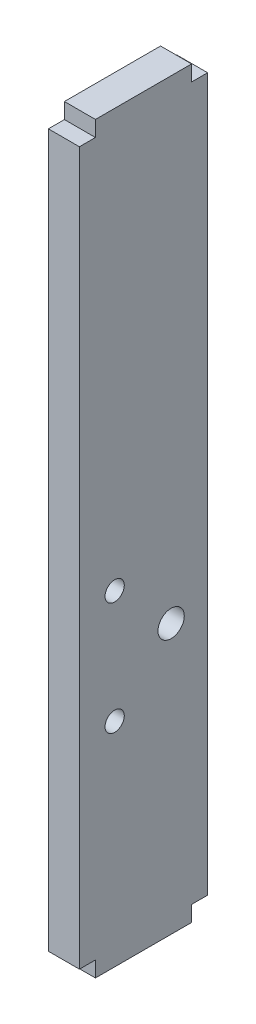
ISO-10303-21;
HEADER;
FILE_DESCRIPTION(('STEP AP214'),'2;1');
FILE_NAME('part.step','',(''),(''),'','','');
FILE_SCHEMA(('AUTOMOTIVE_DESIGN { 1 0 10303 214 1 1 1 1 }'));
ENDSEC;
DATA;
#1=APPLICATION_CONTEXT('core data for automotive mechanical design processes');
#2=APPLICATION_PROTOCOL_DEFINITION('international standard','automotive_design',2000,#1);
#3=PRODUCT_CONTEXT('',#1,'mechanical');
#4=PRODUCT('Part','Part','',(#3));
#5=PRODUCT_RELATED_PRODUCT_CATEGORY('part','',(#4));
#6=PRODUCT_DEFINITION_FORMATION('','',#4);
#7=PRODUCT_DEFINITION_CONTEXT('part definition',#1,'design');
#8=PRODUCT_DEFINITION('design','',#6,#7);
#9=PRODUCT_DEFINITION_SHAPE('','',#8);
#10=(LENGTH_UNIT() NAMED_UNIT(*) SI_UNIT(.MILLI.,.METRE.));
#11=(NAMED_UNIT(*) PLANE_ANGLE_UNIT() SI_UNIT($,.RADIAN.));
#12=(NAMED_UNIT(*) SI_UNIT($,.STERADIAN.) SOLID_ANGLE_UNIT());
#13=UNCERTAINTY_MEASURE_WITH_UNIT(LENGTH_MEASURE(1.E-05),#10,'distance_accuracy_value','');
#14=(GEOMETRIC_REPRESENTATION_CONTEXT(3) GLOBAL_UNCERTAINTY_ASSIGNED_CONTEXT((#13)) GLOBAL_UNIT_ASSIGNED_CONTEXT((#10,
#11,#12)) REPRESENTATION_CONTEXT('',''));
#15=CARTESIAN_POINT('',(0.,0.,0.));
#16=DIRECTION('',(0.,0.,1.));
#17=DIRECTION('',(1.,0.,0.));
#18=AXIS2_PLACEMENT_3D('',#15,#16,#17);
#19=CARTESIAN_POINT('',(4.84,0.,0.));
#20=DIRECTION('',(1.,0.,0.));
#21=DIRECTION('',(0.,0.,-1.));
#22=AXIS2_PLACEMENT_3D('',#19,#20,#21);
#23=PLANE('',#22);
#24=CARTESIAN_POINT('',(4.84,8.81,4.5));
#25=DIRECTION('',(1.,0.,0.));
#26=DIRECTION('',(0.,0.,-1.));
#27=AXIS2_PLACEMENT_3D('',#24,#25,#26);
#28=CIRCLE('',#27,1.5);
#29=CARTESIAN_POINT('',(4.84,8.81,3.));
#30=VERTEX_POINT('',#29);
#31=EDGE_CURVE('E254',#30,#30,#28,.T.);
#32=ORIENTED_EDGE('',*,*,#31,.F.);
#33=EDGE_LOOP('',(#32));
#34=FACE_BOUND('',#33,.T.);
#35=DIRECTION('',(0.,-1.,0.));
#36=VECTOR('',#35,1.);
#37=CARTESIAN_POINT('',(4.84,0.,10.));
#38=LINE('',#37,#36);
#39=CARTESIAN_POINT('',(4.84,71.56,10.));
#40=VERTEX_POINT('',#39);
#41=CARTESIAN_POINT('',(4.84,-39.56,9.99999999999999));
#42=VERTEX_POINT('',#41);
#43=EDGE_CURVE('E51',#40,#42,#38,.T.);
#44=ORIENTED_EDGE('',*,*,#43,.T.);
#45=DIRECTION('',(0.,0.,-1.));
#46=VECTOR('',#45,1.);
#47=CARTESIAN_POINT('',(4.84,-39.56,9.99999999999999));
#48=LINE('',#47,#46);
#49=CARTESIAN_POINT('',(4.84,-39.56,7.5));
#50=VERTEX_POINT('',#49);
#51=EDGE_CURVE('E107',#42,#50,#48,.T.);
#52=ORIENTED_EDGE('',*,*,#51,.T.);
#53=DIRECTION('',(0.,-1.,0.));
#54=VECTOR('',#53,1.);
#55=CARTESIAN_POINT('',(4.84,-42.,7.5));
#56=LINE('',#55,#54);
#57=CARTESIAN_POINT('',(4.84,-42.,7.5));
#58=VERTEX_POINT('',#57);
#59=EDGE_CURVE('E207',#50,#58,#56,.T.);
#60=ORIENTED_EDGE('',*,*,#59,.T.);
#61=DIRECTION('',(0.,0.,-1.));
#62=VECTOR('',#61,1.);
#63=CARTESIAN_POINT('',(4.84,-42.,7.5));
#64=LINE('',#63,#62);
#65=CARTESIAN_POINT('',(4.84,-42.,-7.5));
#66=VERTEX_POINT('',#65);
#67=EDGE_CURVE('E227',#58,#66,#64,.T.);
#68=ORIENTED_EDGE('',*,*,#67,.T.);
#69=DIRECTION('',(0.,1.,0.));
#70=VECTOR('',#69,1.);
#71=CARTESIAN_POINT('',(4.84,-42.,-7.5));
#72=LINE('',#71,#70);
#73=CARTESIAN_POINT('',(4.84,-39.56,-7.5));
#74=VERTEX_POINT('',#73);
#75=EDGE_CURVE('E224',#66,#74,#72,.T.);
#76=ORIENTED_EDGE('',*,*,#75,.T.);
#77=DIRECTION('',(0.,0.,-1.));
#78=VECTOR('',#77,1.);
#79=CARTESIAN_POINT('',(4.84,-39.56,-7.5));
#80=LINE('',#79,#78);
#81=CARTESIAN_POINT('',(4.84,-39.56,-10.));
#82=VERTEX_POINT('',#81);
#83=EDGE_CURVE('E226',#74,#82,#80,.T.);
#84=ORIENTED_EDGE('',*,*,#83,.T.);
#85=DIRECTION('',(0.,1.,0.));
#86=VECTOR('',#85,1.);
#87=CARTESIAN_POINT('',(4.84,71.56,-10.));
#88=LINE('',#87,#86);
#89=CARTESIAN_POINT('',(4.84,71.56,-10.));
#90=VERTEX_POINT('',#89);
#91=EDGE_CURVE('E229',#82,#90,#88,.T.);
#92=ORIENTED_EDGE('',*,*,#91,.T.);
#93=DIRECTION('',(0.,0.,1.));
#94=VECTOR('',#93,1.);
#95=CARTESIAN_POINT('',(4.84,71.56,-7.5));
#96=LINE('',#95,#94);
#97=CARTESIAN_POINT('',(4.84,71.56,-7.5));
#98=VERTEX_POINT('',#97);
#99=EDGE_CURVE('E235',#90,#98,#96,.T.);
#100=ORIENTED_EDGE('',*,*,#99,.T.);
#101=DIRECTION('',(0.,1.,0.));
#102=VECTOR('',#101,1.);
#103=CARTESIAN_POINT('',(4.84,74.,-7.5));
#104=LINE('',#103,#102);
#105=CARTESIAN_POINT('',(4.84,74.,-7.5));
#106=VERTEX_POINT('',#105);
#107=EDGE_CURVE('E139',#98,#106,#104,.T.);
#108=ORIENTED_EDGE('',*,*,#107,.T.);
#109=DIRECTION('',(0.,0.,1.));
#110=VECTOR('',#109,1.);
#111=CARTESIAN_POINT('',(4.84,74.,7.5));
#112=LINE('',#111,#110);
#113=CARTESIAN_POINT('',(4.84,74.,7.5));
#114=VERTEX_POINT('',#113);
#115=EDGE_CURVE('E133',#106,#114,#112,.T.);
#116=ORIENTED_EDGE('',*,*,#115,.T.);
#117=DIRECTION('',(0.,-1.,0.));
#118=VECTOR('',#117,1.);
#119=CARTESIAN_POINT('',(4.84,71.56,7.5));
#120=LINE('',#119,#118);
#121=CARTESIAN_POINT('',(4.84,71.56,7.5));
#122=VERTEX_POINT('',#121);
#123=EDGE_CURVE('E137',#114,#122,#120,.T.);
#124=ORIENTED_EDGE('',*,*,#123,.T.);
#125=DIRECTION('',(0.,0.,1.));
#126=VECTOR('',#125,1.);
#127=CARTESIAN_POINT('',(4.84,71.56,10.));
#128=LINE('',#127,#126);
#129=EDGE_CURVE('E153',#122,#40,#128,.T.);
#130=ORIENTED_EDGE('',*,*,#129,.T.);
#131=EDGE_LOOP('',(#44,#52,#60,#68,#76,#84,#92,#100,#108,#116,#124,#130));
#132=FACE_BOUND('',#131,.T.);
#133=CARTESIAN_POINT('',(4.84,0.,-4.31));
#134=DIRECTION('',(1.,0.,0.));
#135=DIRECTION('',(0.,0.,-1.));
#136=AXIS2_PLACEMENT_3D('',#133,#134,#135);
#137=CIRCLE('',#136,2.05);
#138=CARTESIAN_POINT('',(4.84,0.,-6.36));
#139=VERTEX_POINT('',#138);
#140=EDGE_CURVE('E162',#139,#139,#137,.T.);
#141=ORIENTED_EDGE('',*,*,#140,.F.);
#142=EDGE_LOOP('',(#141));
#143=FACE_BOUND('',#142,.T.);
#144=CARTESIAN_POINT('',(4.84,-8.81,4.5));
#145=DIRECTION('',(1.,0.,0.));
#146=DIRECTION('',(0.,0.,1.));
#147=AXIS2_PLACEMENT_3D('',#144,#145,#146);
#148=CIRCLE('',#147,1.5);
#149=CARTESIAN_POINT('',(4.84,-8.81,6.));
#150=VERTEX_POINT('',#149);
#151=EDGE_CURVE('E260',#150,#150,#148,.T.);
#152=ORIENTED_EDGE('',*,*,#151,.F.);
#153=EDGE_LOOP('',(#152));
#154=FACE_BOUND('',#153,.T.);
#155=ADVANCED_FACE('F34',(#34,#132,#143,#154),#23,.T.);
#156=CARTESIAN_POINT('',(0.,0.,0.));
#157=DIRECTION('',(1.,0.,0.));
#158=DIRECTION('',(0.,0.,-1.));
#159=AXIS2_PLACEMENT_3D('',#156,#157,#158);
#160=PLANE('',#159);
#161=CARTESIAN_POINT('',(0.,8.81,4.5));
#162=DIRECTION('',(1.,0.,0.));
#163=DIRECTION('',(0.,0.,-1.));
#164=AXIS2_PLACEMENT_3D('',#161,#162,#163);
#165=CIRCLE('',#164,1.5);
#166=CARTESIAN_POINT('',(0.,8.81,3.));
#167=VERTEX_POINT('',#166);
#168=EDGE_CURVE('E257',#167,#167,#165,.T.);
#169=ORIENTED_EDGE('',*,*,#168,.T.);
#170=EDGE_LOOP('',(#169));
#171=FACE_BOUND('',#170,.T.);
#172=DIRECTION('',(0.,0.,-1.));
#173=VECTOR('',#172,1.);
#174=CARTESIAN_POINT('',(0.,-39.56,9.99999999999999));
#175=LINE('',#174,#173);
#176=CARTESIAN_POINT('',(0.,-39.56,9.99999999999999));
#177=VERTEX_POINT('',#176);
#178=CARTESIAN_POINT('',(0.,-39.56,7.5));
#179=VERTEX_POINT('',#178);
#180=EDGE_CURVE('E159',#177,#179,#175,.T.);
#181=ORIENTED_EDGE('',*,*,#180,.F.);
#182=DIRECTION('',(0.,-1.,0.));
#183=VECTOR('',#182,1.);
#184=CARTESIAN_POINT('',(0.,0.,10.));
#185=LINE('',#184,#183);
#186=CARTESIAN_POINT('',(0.,71.56,10.));
#187=VERTEX_POINT('',#186);
#188=EDGE_CURVE('E179',#187,#177,#185,.T.);
#189=ORIENTED_EDGE('',*,*,#188,.F.);
#190=DIRECTION('',(0.,0.,1.));
#191=VECTOR('',#190,1.);
#192=CARTESIAN_POINT('',(0.,71.56,10.));
#193=LINE('',#192,#191);
#194=CARTESIAN_POINT('',(0.,71.56,7.5));
#195=VERTEX_POINT('',#194);
#196=EDGE_CURVE('E100',#195,#187,#193,.T.);
#197=ORIENTED_EDGE('',*,*,#196,.F.);
#198=DIRECTION('',(0.,-1.,0.));
#199=VECTOR('',#198,1.);
#200=CARTESIAN_POINT('',(0.,71.56,7.5));
#201=LINE('',#200,#199);
#202=CARTESIAN_POINT('',(0.,74.,7.5));
#203=VERTEX_POINT('',#202);
#204=EDGE_CURVE('E93',#203,#195,#201,.T.);
#205=ORIENTED_EDGE('',*,*,#204,.F.);
#206=DIRECTION('',(0.,0.,1.));
#207=VECTOR('',#206,1.);
#208=CARTESIAN_POINT('',(0.,74.,7.5));
#209=LINE('',#208,#207);
#210=CARTESIAN_POINT('',(0.,74.,-7.5));
#211=VERTEX_POINT('',#210);
#212=EDGE_CURVE('E147',#211,#203,#209,.T.);
#213=ORIENTED_EDGE('',*,*,#212,.F.);
#214=DIRECTION('',(0.,1.,0.));
#215=VECTOR('',#214,1.);
#216=CARTESIAN_POINT('',(0.,74.,-7.5));
#217=LINE('',#216,#215);
#218=CARTESIAN_POINT('',(0.,71.56,-7.5));
#219=VERTEX_POINT('',#218);
#220=EDGE_CURVE('E174',#219,#211,#217,.T.);
#221=ORIENTED_EDGE('',*,*,#220,.F.);
#222=DIRECTION('',(0.,0.,1.));
#223=VECTOR('',#222,1.);
#224=CARTESIAN_POINT('',(0.,71.56,-7.5));
#225=LINE('',#224,#223);
#226=CARTESIAN_POINT('',(0.,71.56,-10.));
#227=VERTEX_POINT('',#226);
#228=EDGE_CURVE('E172',#227,#219,#225,.T.);
#229=ORIENTED_EDGE('',*,*,#228,.F.);
#230=DIRECTION('',(0.,1.,0.));
#231=VECTOR('',#230,1.);
#232=CARTESIAN_POINT('',(0.,71.56,-10.));
#233=LINE('',#232,#231);
#234=CARTESIAN_POINT('',(0.,-39.56,-10.));
#235=VERTEX_POINT('',#234);
#236=EDGE_CURVE('E170',#235,#227,#233,.T.);
#237=ORIENTED_EDGE('',*,*,#236,.F.);
#238=DIRECTION('',(0.,0.,-1.));
#239=VECTOR('',#238,1.);
#240=CARTESIAN_POINT('',(0.,-39.56,-7.5));
#241=LINE('',#240,#239);
#242=CARTESIAN_POINT('',(0.,-39.56,-7.5));
#243=VERTEX_POINT('',#242);
#244=EDGE_CURVE('E168',#243,#235,#241,.T.);
#245=ORIENTED_EDGE('',*,*,#244,.F.);
#246=DIRECTION('',(0.,1.,0.));
#247=VECTOR('',#246,1.);
#248=CARTESIAN_POINT('',(0.,-42.,-7.5));
#249=LINE('',#248,#247);
#250=CARTESIAN_POINT('',(0.,-42.,-7.5));
#251=VERTEX_POINT('',#250);
#252=EDGE_CURVE('E166',#251,#243,#249,.T.);
#253=ORIENTED_EDGE('',*,*,#252,.F.);
#254=DIRECTION('',(0.,0.,-1.));
#255=VECTOR('',#254,1.);
#256=CARTESIAN_POINT('',(0.,-42.,7.5));
#257=LINE('',#256,#255);
#258=CARTESIAN_POINT('',(0.,-42.,7.5));
#259=VERTEX_POINT('',#258);
#260=EDGE_CURVE('E164',#259,#251,#257,.T.);
#261=ORIENTED_EDGE('',*,*,#260,.F.);
#262=DIRECTION('',(0.,-1.,0.));
#263=VECTOR('',#262,1.);
#264=CARTESIAN_POINT('',(0.,-42.,7.5));
#265=LINE('',#264,#263);
#266=EDGE_CURVE('E161',#179,#259,#265,.T.);
#267=ORIENTED_EDGE('',*,*,#266,.F.);
#268=EDGE_LOOP('',(#181,#189,#197,#205,#213,#221,#229,#237,#245,#253,#261,#267));
#269=FACE_BOUND('',#268,.T.);
#270=CARTESIAN_POINT('',(0.,0.,-4.31));
#271=DIRECTION('',(1.,0.,0.));
#272=DIRECTION('',(0.,0.,-1.));
#273=AXIS2_PLACEMENT_3D('',#270,#271,#272);
#274=CIRCLE('',#273,2.05);
#275=CARTESIAN_POINT('',(0.,0.,-6.36));
#276=VERTEX_POINT('',#275);
#277=EDGE_CURVE('E251',#276,#276,#274,.T.);
#278=ORIENTED_EDGE('',*,*,#277,.T.);
#279=EDGE_LOOP('',(#278));
#280=FACE_BOUND('',#279,.T.);
#281=CARTESIAN_POINT('',(0.,-8.81,4.5));
#282=DIRECTION('',(1.,0.,0.));
#283=DIRECTION('',(0.,0.,1.));
#284=AXIS2_PLACEMENT_3D('',#281,#282,#283);
#285=CIRCLE('',#284,1.5);
#286=CARTESIAN_POINT('',(0.,-8.81,6.));
#287=VERTEX_POINT('',#286);
#288=EDGE_CURVE('E263',#287,#287,#285,.T.);
#289=ORIENTED_EDGE('',*,*,#288,.T.);
#290=EDGE_LOOP('',(#289));
#291=FACE_BOUND('',#290,.T.);
#292=ADVANCED_FACE('F211',(#171,#269,#280,#291),#160,.F.);
#293=CARTESIAN_POINT('',(4.84,-39.56,9.99999999999999));
#294=DIRECTION('',(0.,1.,0.));
#295=DIRECTION('',(0.,0.,1.));
#296=AXIS2_PLACEMENT_3D('',#293,#294,#295);
#297=PLANE('',#296);
#298=ORIENTED_EDGE('',*,*,#180,.T.);
#299=DIRECTION('',(-1.,0.,0.));
#300=VECTOR('',#299,1.);
#301=CARTESIAN_POINT('',(4.84,-39.56,7.5));
#302=LINE('',#301,#300);
#303=EDGE_CURVE('E43',#50,#179,#302,.T.);
#304=ORIENTED_EDGE('',*,*,#303,.F.);
#305=ORIENTED_EDGE('',*,*,#51,.F.);
#306=DIRECTION('',(-1.,0.,0.));
#307=VECTOR('',#306,1.);
#308=CARTESIAN_POINT('',(4.84,-39.56,9.99999999999999));
#309=LINE('',#308,#307);
#310=EDGE_CURVE('E11',#42,#177,#309,.T.);
#311=ORIENTED_EDGE('',*,*,#310,.T.);
#312=EDGE_LOOP('',(#298,#304,#305,#311));
#313=FACE_BOUND('',#312,.T.);
#314=ADVANCED_FACE('F36',(#313),#297,.F.);
#315=CARTESIAN_POINT('',(4.84,-42.,7.5));
#316=DIRECTION('',(0.,0.,-1.));
#317=DIRECTION('',(-1.,0.,0.));
#318=AXIS2_PLACEMENT_3D('',#315,#316,#317);
#319=PLANE('',#318);
#320=ORIENTED_EDGE('',*,*,#266,.T.);
#321=DIRECTION('',(-1.,0.,0.));
#322=VECTOR('',#321,1.);
#323=CARTESIAN_POINT('',(4.84,-42.,7.5));
#324=LINE('',#323,#322);
#325=EDGE_CURVE('E199',#58,#259,#324,.T.);
#326=ORIENTED_EDGE('',*,*,#325,.F.);
#327=ORIENTED_EDGE('',*,*,#59,.F.);
#328=ORIENTED_EDGE('',*,*,#303,.T.);
#329=EDGE_LOOP('',(#320,#326,#327,#328));
#330=FACE_BOUND('',#329,.T.);
#331=ADVANCED_FACE('F205',(#330),#319,.F.);
#332=CARTESIAN_POINT('',(4.84,-42.,7.5));
#333=DIRECTION('',(0.,1.,0.));
#334=DIRECTION('',(0.,0.,1.));
#335=AXIS2_PLACEMENT_3D('',#332,#333,#334);
#336=PLANE('',#335);
#337=ORIENTED_EDGE('',*,*,#260,.T.);
#338=DIRECTION('',(-1.,0.,0.));
#339=VECTOR('',#338,1.);
#340=CARTESIAN_POINT('',(4.84,-42.,-7.5));
#341=LINE('',#340,#339);
#342=EDGE_CURVE('E196',#66,#251,#341,.T.);
#343=ORIENTED_EDGE('',*,*,#342,.F.);
#344=ORIENTED_EDGE('',*,*,#67,.F.);
#345=ORIENTED_EDGE('',*,*,#325,.T.);
#346=EDGE_LOOP('',(#337,#343,#344,#345));
#347=FACE_BOUND('',#346,.T.);
#348=ADVANCED_FACE('F218',(#347),#336,.F.);
#349=CARTESIAN_POINT('',(4.84,-42.,-7.5));
#350=DIRECTION('',(0.,0.,1.));
#351=DIRECTION('',(1.,0.,0.));
#352=AXIS2_PLACEMENT_3D('',#349,#350,#351);
#353=PLANE('',#352);
#354=ORIENTED_EDGE('',*,*,#252,.T.);
#355=DIRECTION('',(-1.,0.,0.));
#356=VECTOR('',#355,1.);
#357=CARTESIAN_POINT('',(4.84,-39.56,-7.5));
#358=LINE('',#357,#356);
#359=EDGE_CURVE('E193',#74,#243,#358,.T.);
#360=ORIENTED_EDGE('',*,*,#359,.F.);
#361=ORIENTED_EDGE('',*,*,#75,.F.);
#362=ORIENTED_EDGE('',*,*,#342,.T.);
#363=EDGE_LOOP('',(#354,#360,#361,#362));
#364=FACE_BOUND('',#363,.T.);
#365=ADVANCED_FACE('F222',(#364),#353,.F.);
#366=CARTESIAN_POINT('',(4.84,-39.56,-7.5));
#367=DIRECTION('',(0.,1.,0.));
#368=DIRECTION('',(0.,0.,1.));
#369=AXIS2_PLACEMENT_3D('',#366,#367,#368);
#370=PLANE('',#369);
#371=ORIENTED_EDGE('',*,*,#244,.T.);
#372=DIRECTION('',(-1.,0.,0.));
#373=VECTOR('',#372,1.);
#374=CARTESIAN_POINT('',(4.84,-39.56,-10.));
#375=LINE('',#374,#373);
#376=EDGE_CURVE('E190',#82,#235,#375,.T.);
#377=ORIENTED_EDGE('',*,*,#376,.F.);
#378=ORIENTED_EDGE('',*,*,#83,.F.);
#379=ORIENTED_EDGE('',*,*,#359,.T.);
#380=EDGE_LOOP('',(#371,#377,#378,#379));
#381=FACE_BOUND('',#380,.T.);
#382=ADVANCED_FACE('F300',(#381),#370,.F.);
#383=CARTESIAN_POINT('',(4.84,71.56,-10.));
#384=DIRECTION('',(0.,0.,1.));
#385=DIRECTION('',(0.,-1.,0.));
#386=AXIS2_PLACEMENT_3D('',#383,#384,#385);
#387=PLANE('',#386);
#388=ORIENTED_EDGE('',*,*,#236,.T.);
#389=DIRECTION('',(-1.,0.,0.));
#390=VECTOR('',#389,1.);
#391=CARTESIAN_POINT('',(4.84,71.56,-10.));
#392=LINE('',#391,#390);
#393=EDGE_CURVE('E187',#90,#227,#392,.T.);
#394=ORIENTED_EDGE('',*,*,#393,.F.);
#395=ORIENTED_EDGE('',*,*,#91,.F.);
#396=ORIENTED_EDGE('',*,*,#376,.T.);
#397=EDGE_LOOP('',(#388,#394,#395,#396));
#398=FACE_BOUND('',#397,.T.);
#399=ADVANCED_FACE('F297',(#398),#387,.F.);
#400=CARTESIAN_POINT('',(4.84,71.56,-7.5));
#401=DIRECTION('',(0.,-1.,0.));
#402=DIRECTION('',(0.,0.,-1.));
#403=AXIS2_PLACEMENT_3D('',#400,#401,#402);
#404=PLANE('',#403);
#405=ORIENTED_EDGE('',*,*,#228,.T.);
#406=DIRECTION('',(-1.,0.,0.));
#407=VECTOR('',#406,1.);
#408=CARTESIAN_POINT('',(4.84,71.56,-7.5));
#409=LINE('',#408,#407);
#410=EDGE_CURVE('E184',#98,#219,#409,.T.);
#411=ORIENTED_EDGE('',*,*,#410,.F.);
#412=ORIENTED_EDGE('',*,*,#99,.F.);
#413=ORIENTED_EDGE('',*,*,#393,.T.);
#414=EDGE_LOOP('',(#405,#411,#412,#413));
#415=FACE_BOUND('',#414,.T.);
#416=ADVANCED_FACE('F241',(#415),#404,.F.);
#417=CARTESIAN_POINT('',(4.84,74.,-7.5));
#418=DIRECTION('',(0.,0.,1.));
#419=DIRECTION('',(1.,0.,0.));
#420=AXIS2_PLACEMENT_3D('',#417,#418,#419);
#421=PLANE('',#420);
#422=ORIENTED_EDGE('',*,*,#220,.T.);
#423=DIRECTION('',(-1.,0.,0.));
#424=VECTOR('',#423,1.);
#425=CARTESIAN_POINT('',(4.84,74.,-7.5));
#426=LINE('',#425,#424);
#427=EDGE_CURVE('E148',#106,#211,#426,.T.);
#428=ORIENTED_EDGE('',*,*,#427,.F.);
#429=ORIENTED_EDGE('',*,*,#107,.F.);
#430=ORIENTED_EDGE('',*,*,#410,.T.);
#431=EDGE_LOOP('',(#422,#428,#429,#430));
#432=FACE_BOUND('',#431,.T.);
#433=ADVANCED_FACE('F245',(#432),#421,.F.);
#434=CARTESIAN_POINT('',(4.84,74.,7.5));
#435=DIRECTION('',(0.,-1.,0.));
#436=DIRECTION('',(0.,0.,-1.));
#437=AXIS2_PLACEMENT_3D('',#434,#435,#436);
#438=PLANE('',#437);
#439=ORIENTED_EDGE('',*,*,#212,.T.);
#440=DIRECTION('',(-1.,0.,0.));
#441=VECTOR('',#440,1.);
#442=CARTESIAN_POINT('',(4.84,74.,7.5));
#443=LINE('',#442,#441);
#444=EDGE_CURVE('E144',#114,#203,#443,.T.);
#445=ORIENTED_EDGE('',*,*,#444,.F.);
#446=ORIENTED_EDGE('',*,*,#115,.F.);
#447=ORIENTED_EDGE('',*,*,#427,.T.);
#448=EDGE_LOOP('',(#439,#445,#446,#447));
#449=FACE_BOUND('',#448,.T.);
#450=ADVANCED_FACE('F145',(#449),#438,.F.);
#451=CARTESIAN_POINT('',(4.84,71.56,7.5));
#452=DIRECTION('',(0.,0.,-1.));
#453=DIRECTION('',(-1.,0.,0.));
#454=AXIS2_PLACEMENT_3D('',#451,#452,#453);
#455=PLANE('',#454);
#456=ORIENTED_EDGE('',*,*,#204,.T.);
#457=DIRECTION('',(-1.,0.,0.));
#458=VECTOR('',#457,1.);
#459=CARTESIAN_POINT('',(4.84,71.56,7.5));
#460=LINE('',#459,#458);
#461=EDGE_CURVE('E149',#122,#195,#460,.T.);
#462=ORIENTED_EDGE('',*,*,#461,.F.);
#463=ORIENTED_EDGE('',*,*,#123,.F.);
#464=ORIENTED_EDGE('',*,*,#444,.T.);
#465=EDGE_LOOP('',(#456,#462,#463,#464));
#466=FACE_BOUND('',#465,.T.);
#467=ADVANCED_FACE('F151',(#466),#455,.F.);
#468=CARTESIAN_POINT('',(4.84,71.56,10.));
#469=DIRECTION('',(0.,-1.,0.));
#470=DIRECTION('',(0.,0.,-1.));
#471=AXIS2_PLACEMENT_3D('',#468,#469,#470);
#472=PLANE('',#471);
#473=ORIENTED_EDGE('',*,*,#196,.T.);
#474=DIRECTION('',(-1.,0.,0.));
#475=VECTOR('',#474,1.);
#476=CARTESIAN_POINT('',(4.84,71.56,10.));
#477=LINE('',#476,#475);
#478=EDGE_CURVE('E155',#40,#187,#477,.T.);
#479=ORIENTED_EDGE('',*,*,#478,.F.);
#480=ORIENTED_EDGE('',*,*,#129,.F.);
#481=ORIENTED_EDGE('',*,*,#461,.T.);
#482=EDGE_LOOP('',(#473,#479,#480,#481));
#483=FACE_BOUND('',#482,.T.);
#484=ADVANCED_FACE('F247',(#483),#472,.F.);
#485=CARTESIAN_POINT('',(4.84,0.,10.));
#486=DIRECTION('',(0.,0.,-1.));
#487=DIRECTION('',(-1.,0.,0.));
#488=AXIS2_PLACEMENT_3D('',#485,#486,#487);
#489=PLANE('',#488);
#490=ORIENTED_EDGE('',*,*,#188,.T.);
#491=ORIENTED_EDGE('',*,*,#310,.F.);
#492=ORIENTED_EDGE('',*,*,#43,.F.);
#493=ORIENTED_EDGE('',*,*,#478,.T.);
#494=EDGE_LOOP('',(#490,#491,#492,#493));
#495=FACE_BOUND('',#494,.T.);
#496=ADVANCED_FACE('F246',(#495),#489,.F.);
#497=CARTESIAN_POINT('',(4.84,0.,-4.31));
#498=DIRECTION('',(-1.,0.,0.));
#499=DIRECTION('',(0.,0.,1.));
#500=AXIS2_PLACEMENT_3D('',#497,#498,#499);
#501=CYLINDRICAL_SURFACE('',#500,2.05);
#502=ORIENTED_EDGE('',*,*,#140,.T.);
#503=EDGE_LOOP('',(#502));
#504=FACE_BOUND('',#503,.T.);
#505=ORIENTED_EDGE('',*,*,#277,.F.);
#506=EDGE_LOOP('',(#505));
#507=FACE_BOUND('',#506,.T.);
#508=ADVANCED_FACE('F282',(#504,#507),#501,.F.);
#509=CARTESIAN_POINT('',(4.84,8.81,4.5));
#510=DIRECTION('',(-1.,0.,0.));
#511=DIRECTION('',(0.,0.,1.));
#512=AXIS2_PLACEMENT_3D('',#509,#510,#511);
#513=CYLINDRICAL_SURFACE('',#512,1.5);
#514=ORIENTED_EDGE('',*,*,#31,.T.);
#515=EDGE_LOOP('',(#514));
#516=FACE_BOUND('',#515,.T.);
#517=ORIENTED_EDGE('',*,*,#168,.F.);
#518=EDGE_LOOP('',(#517));
#519=FACE_BOUND('',#518,.T.);
#520=ADVANCED_FACE('F391',(#516,#519),#513,.F.);
#521=CARTESIAN_POINT('',(4.84,-8.81,4.5));
#522=DIRECTION('',(-1.,0.,0.));
#523=DIRECTION('',(0.,0.,1.));
#524=AXIS2_PLACEMENT_3D('',#521,#522,#523);
#525=CYLINDRICAL_SURFACE('',#524,1.5);
#526=ORIENTED_EDGE('',*,*,#151,.T.);
#527=EDGE_LOOP('',(#526));
#528=FACE_BOUND('',#527,.T.);
#529=ORIENTED_EDGE('',*,*,#288,.F.);
#530=EDGE_LOOP('',(#529));
#531=FACE_BOUND('',#530,.T.);
#532=ADVANCED_FACE('F269',(#528,#531),#525,.F.);
#533=CLOSED_SHELL('',(#155,#292,#314,#331,#348,#365,#382,#399,#416,#433,#450,#467,#484,#496,
#508,#520,#532));
#534=MANIFOLD_SOLID_BREP('B2',#533);
#535=ADVANCED_BREP_SHAPE_REPRESENTATION('',(#18,#534),#14);
#536=SHAPE_DEFINITION_REPRESENTATION(#9,#535);
ENDSEC;
END-ISO-10303-21;
